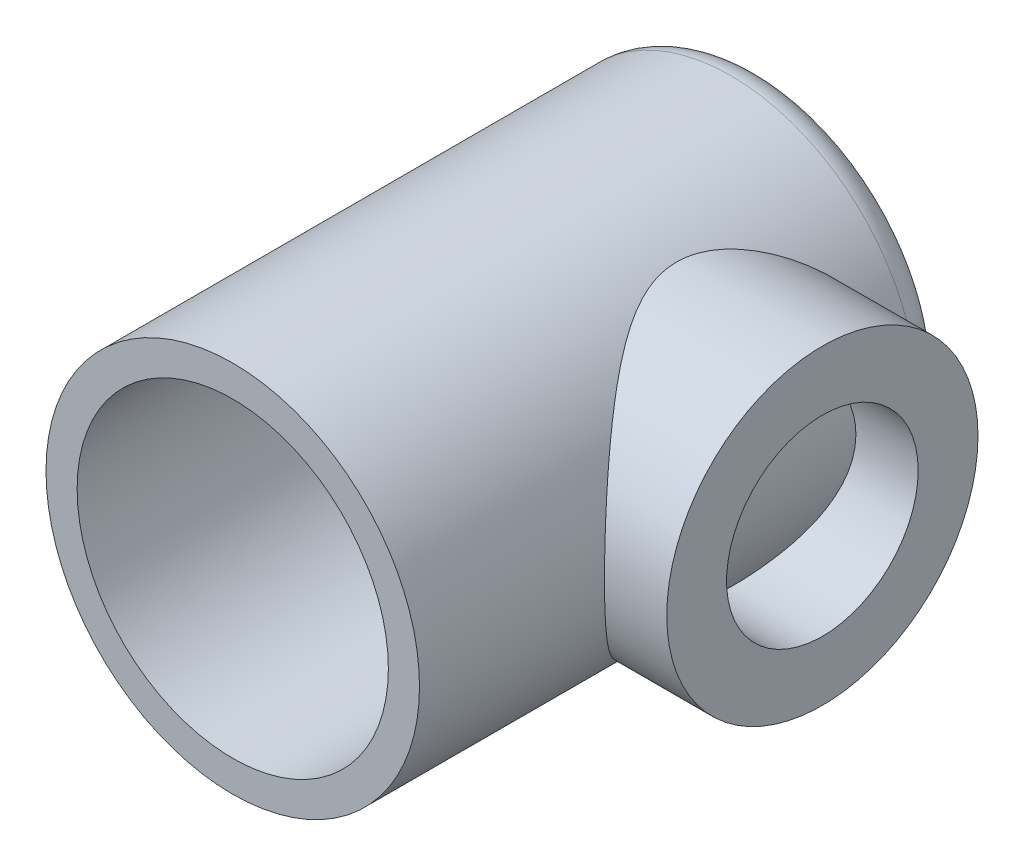
ISO-10303-21;
HEADER;
FILE_DESCRIPTION(('STEP AP214'),'2;1');
FILE_NAME('part.step','',(''),(''),'','','');
FILE_SCHEMA(('AUTOMOTIVE_DESIGN { 1 0 10303 214 1 1 1 1 }'));
ENDSEC;
DATA;
#1=APPLICATION_CONTEXT('core data for automotive mechanical design processes');
#2=APPLICATION_PROTOCOL_DEFINITION('international standard','automotive_design',2000,#1);
#3=PRODUCT_CONTEXT('',#1,'mechanical');
#4=PRODUCT('Part','Part','',(#3));
#5=PRODUCT_RELATED_PRODUCT_CATEGORY('part','',(#4));
#6=PRODUCT_DEFINITION_FORMATION('','',#4);
#7=PRODUCT_DEFINITION_CONTEXT('part definition',#1,'design');
#8=PRODUCT_DEFINITION('design','',#6,#7);
#9=PRODUCT_DEFINITION_SHAPE('','',#8);
#10=(LENGTH_UNIT() NAMED_UNIT(*) SI_UNIT(.MILLI.,.METRE.));
#11=(NAMED_UNIT(*) PLANE_ANGLE_UNIT() SI_UNIT($,.RADIAN.));
#12=(NAMED_UNIT(*) SI_UNIT($,.STERADIAN.) SOLID_ANGLE_UNIT());
#13=UNCERTAINTY_MEASURE_WITH_UNIT(LENGTH_MEASURE(1.E-05),#10,'distance_accuracy_value','');
#14=(GEOMETRIC_REPRESENTATION_CONTEXT(3) GLOBAL_UNCERTAINTY_ASSIGNED_CONTEXT((#13)) GLOBAL_UNIT_ASSIGNED_CONTEXT((#10,
#11,#12)) REPRESENTATION_CONTEXT('',''));
#15=CARTESIAN_POINT('',(0.,0.,0.));
#16=DIRECTION('',(0.,0.,1.));
#17=DIRECTION('',(1.,0.,0.));
#18=AXIS2_PLACEMENT_3D('',#15,#16,#17);
#19=CARTESIAN_POINT('',(0.,0.,0.));
#20=DIRECTION('',(0.,0.,1.));
#21=DIRECTION('',(1.,0.,0.));
#22=AXIS2_PLACEMENT_3D('',#19,#20,#21);
#23=CYLINDRICAL_SURFACE('',#22,3.);
#24=CARTESIAN_POINT('',(0.,0.,0.));
#25=DIRECTION('',(0.,0.,-1.));
#26=DIRECTION('',(-1.,0.,0.));
#27=AXIS2_PLACEMENT_3D('',#24,#25,#26);
#28=CIRCLE('',#27,3.);
#29=CARTESIAN_POINT('',(-3.,0.,0.));
#30=VERTEX_POINT('',#29);
#31=EDGE_CURVE('E10',#30,#30,#28,.F.);
#32=ORIENTED_EDGE('',*,*,#31,.T.);
#33=EDGE_LOOP('',(#32));
#34=FACE_BOUND('',#33,.T.);
#35=CARTESIAN_POINT('',(3.,0.,0.0279198848584191));
#36=CARTESIAN_POINT('',(2.99999522795205,0.118757533193203,0.0279247704121019));
#37=CARTESIAN_POINT('',(2.99288670594742,0.237551281104128,0.0364423887629974));
#38=CARTESIAN_POINT('',(2.96510762868268,0.471182492492811,0.069882608210253));
#39=CARTESIAN_POINT('',(2.94442702942007,0.586016959612417,0.0948173588337277));
#40=CARTESIAN_POINT('',(2.89142690238865,0.807829942407297,0.159232002191125));
#41=CARTESIAN_POINT('',(2.8591769655007,0.914850920904901,0.198624959212131));
#42=CARTESIAN_POINT('',(2.78529176182903,1.11984139043408,0.289936932800996));
#43=CARTESIAN_POINT('',(2.74365332434937,1.21780780775233,0.341860181531668));
#44=CARTESIAN_POINT('',(2.63674191529867,1.43789998519767,0.477373634666574));
#45=CARTESIAN_POINT('',(2.56840549256191,1.5556821965722,0.565590089040597));
#46=CARTESIAN_POINT('',(2.42422624777674,1.77202398328147,0.758444210609786));
#47=CARTESIAN_POINT('',(2.34836281453276,1.87052845158605,0.863127454101528));
#48=CARTESIAN_POINT('',(2.23294886313738,2.00437263805588,1.03200416134951));
#49=CARTESIAN_POINT('',(2.19383679994997,2.04699726278816,1.09087546104972));
#50=CARTESIAN_POINT('',(2.11620611809193,2.12715295529554,1.21242548781892));
#51=CARTESIAN_POINT('',(2.07768770195023,2.16468231743739,1.27510547972916));
#52=CARTESIAN_POINT('',(2.00250543288661,2.23441122570746,1.40418720919403));
#53=CARTESIAN_POINT('',(1.96583735754651,2.26662332666227,1.47057966958324));
#54=CARTESIAN_POINT('',(1.89577686630311,2.32553690612792,1.60736616878681));
#55=CARTESIAN_POINT('',(1.86238167220904,2.3522430799868,1.67775673220021));
#56=CARTESIAN_POINT('',(1.79791918980412,2.40193513934005,1.82958697505852));
#57=CARTESIAN_POINT('',(1.76736311251003,2.42433807692598,1.9114439775819));
#58=CARTESIAN_POINT('',(1.71593180556003,2.46101313675502,2.07980965367152));
#59=CARTESIAN_POINT('',(1.69503310194197,2.47530499393792,2.16630647147309));
#60=CARTESIAN_POINT('',(1.66620928968844,2.49481072799048,2.34368529323787));
#61=CARTESIAN_POINT('',(1.65844510563093,2.49991205058667,2.43460784392911));
#62=CARTESIAN_POINT('',(1.65818308531825,2.5000856937119,2.61648249786118));
#63=CARTESIAN_POINT('',(1.6656854491694,2.49515788278405,2.70743460147375));
#64=CARTESIAN_POINT('',(1.69541639464497,2.47505262029594,2.89344459568554));
#65=CARTESIAN_POINT('',(1.71881932066467,2.45905577113332,2.98821363057548));
#66=CARTESIAN_POINT('',(1.77688235738914,2.41742550503027,3.17213086606059));
#67=CARTESIAN_POINT('',(1.81157977103025,2.39176011044289,3.26125925557324));
#68=CARTESIAN_POINT('',(1.88002226126137,2.33816270346873,3.41574696339952));
#69=CARTESIAN_POINT('',(1.91250316845439,2.31177513033566,3.48223212727007));
#70=CARTESIAN_POINT('',(1.98021996661529,2.25404424958636,3.61157069163835));
#71=CARTESIAN_POINT('',(2.01545746697786,2.22269803586306,3.67442193272425));
#72=CARTESIAN_POINT('',(2.12342648109725,2.12149677560466,3.85788672587809));
#73=CARTESIAN_POINT('',(2.19837696967438,2.04450664231777,3.9733340324645));
#74=CARTESIAN_POINT('',(2.35079897952278,1.86765914501414,4.19618684731277));
#75=CARTESIAN_POINT('',(2.42819792618945,1.76681805277628,4.3028582088503));
#76=CARTESIAN_POINT('',(2.57509054043285,1.54484388336149,4.49903222967582));
#77=CARTESIAN_POINT('',(2.64460112267364,1.42375565615773,4.58857191791468));
#78=CARTESIAN_POINT('',(2.75428914126547,1.19411179169416,4.72733472395697));
#79=CARTESIAN_POINT('',(2.79748350073995,1.08972732107277,4.78106278304607));
#80=CARTESIAN_POINT('',(2.87307804019801,0.871071458330365,4.87426263011376));
#81=CARTESIAN_POINT('',(2.90548495660805,0.756806292780761,4.91374331643899));
#82=CARTESIAN_POINT('',(2.95709834265565,0.519954301215417,4.97633713479062));
#83=CARTESIAN_POINT('',(2.97620280955844,0.397310923125307,4.99932383151598));
#84=CARTESIAN_POINT('',(2.99891434528972,0.148559976923725,5.0266291167856));
#85=CARTESIAN_POINT('',(3.00253178304177,0.0224547835239998,5.03096019570858));
#86=CARTESIAN_POINT('',(2.99444999039147,-0.213310199456577,5.02125744541466));
#87=CARTESIAN_POINT('',(2.98453350716313,-0.323130540835861,5.00936124614325));
#88=CARTESIAN_POINT('',(2.95325589460135,-0.538644964400607,4.97165293464693));
#89=CARTESIAN_POINT('',(2.93189339242796,-0.644338549989564,4.94583915313945));
#90=CARTESIAN_POINT('',(2.87889521546186,-0.850565499199259,4.88129648940316));
#91=CARTESIAN_POINT('',(2.84712564891974,-0.951010682223319,4.84239909541415));
#92=CARTESIAN_POINT('',(2.77536124733889,-1.14365900898104,4.75352425252172));
#93=CARTESIAN_POINT('',(2.73536337221808,-1.2358590883121,4.70354270786512));
#94=CARTESIAN_POINT('',(2.62975152158594,-1.450674397351,4.56948808951145));
#95=CARTESIAN_POINT('',(2.56070244234714,-1.56834359540731,4.48018730159111));
#96=CARTESIAN_POINT('',(2.4152244540319,-1.78428994740848,4.28507950220278));
#97=CARTESIAN_POINT('',(2.33877300422834,-1.88250490855173,4.17922142950367));
#98=CARTESIAN_POINT('',(2.222698055986,-2.01573314784291,4.0085079169298));
#99=CARTESIAN_POINT('',(2.1834115173603,-2.05811069143949,3.94902161188243));
#100=CARTESIAN_POINT('',(2.10553153817181,-2.13771669597406,3.82619906882614));
#101=CARTESIAN_POINT('',(2.06693835133607,-2.17494330406755,3.76286145719432));
#102=CARTESIAN_POINT('',(1.99176108482639,-2.24398857026758,3.63243148094323));
#103=CARTESIAN_POINT('',(1.95517188634212,-2.27582148781538,3.56534966032481));
#104=CARTESIAN_POINT('',(1.88547561448179,-2.3338885673946,3.42712978035859));
#105=CARTESIAN_POINT('',(1.8523653645079,-2.36012785984655,3.35599551443904));
#106=CARTESIAN_POINT('',(1.78925557416047,-2.40837357148322,3.20364951650653));
#107=CARTESIAN_POINT('',(1.75970711786653,-2.42988314318545,3.12208543378469));
#108=CARTESIAN_POINT('',(1.71043063887427,-2.46482255689514,2.95446793091581));
#109=CARTESIAN_POINT('',(1.69067811225259,-2.47827257713357,2.86842631353054));
#110=CARTESIAN_POINT('',(1.6641531597946,-2.49617289535263,2.69228227744608));
#111=CARTESIAN_POINT('',(1.65753251048391,-2.5005179918396,2.60214455510773));
#112=CARTESIAN_POINT('',(1.65924308630667,-2.49938197104455,2.42206667207448));
#113=CARTESIAN_POINT('',(1.66757825402155,-2.49389826274012,2.33212656973328));
#114=CARTESIAN_POINT('',(1.69892898735519,-2.4726526384854,2.14624730946789));
#115=CARTESIAN_POINT('',(1.72341371023858,-2.45585812550761,2.05068961432574));
#116=CARTESIAN_POINT('',(1.78358728037387,-2.41250339675091,1.86538858877571));
#117=CARTESIAN_POINT('',(1.81931312531326,-2.38591088285909,1.77566565614912));
#118=CARTESIAN_POINT('',(1.88952619366194,-2.33050835844919,1.62013084350357));
#119=CARTESIAN_POINT('',(1.92277816627791,-2.30325853049531,1.55317612562349));
#120=CARTESIAN_POINT('',(1.99195185230571,-2.24370627018012,1.42297349843401));
#121=CARTESIAN_POINT('',(2.0278751115052,-2.21140090020864,1.3597277738586));
#122=CARTESIAN_POINT('',(2.13775931167913,-2.10716294428985,1.17519032351646));
#123=CARTESIAN_POINT('',(2.2137978016432,-2.02793576743751,1.05917295986648));
#124=CARTESIAN_POINT('',(2.36772603763547,-1.84629697567413,0.835912623567164));
#125=CARTESIAN_POINT('',(2.44552394429513,-1.7429395959328,0.72937809082549));
#126=CARTESIAN_POINT('',(2.59256498427755,-1.5155355493562,0.534056085319074));
#127=CARTESIAN_POINT('',(2.66182692543068,-1.39153583663215,0.445229318984465));
#128=CARTESIAN_POINT('',(2.76942305781509,-1.15855518141082,0.309605688135323));
#129=CARTESIAN_POINT('',(2.81112174006883,-1.05399877947693,0.257881374638973));
#130=CARTESIAN_POINT('',(2.88361460666453,-0.835439786054351,0.168701214619839));
#131=CARTESIAN_POINT('',(2.9144233132377,-0.721450026753897,0.131226360763123));
#132=CARTESIAN_POINT('',(2.95858745904691,-0.506620038886852,0.0777314290318304));
#133=CARTESIAN_POINT('',(2.97402142398111,-0.406845468761919,0.0591447626316421));
#134=CARTESIAN_POINT('',(2.99472922794408,-0.204722725654234,0.0342375166203394));
#135=CARTESIAN_POINT('',(3.00000411373941,-0.102374818922783,0.0279156732714977));
#136=CARTESIAN_POINT('',(3.,0.,0.0279198848584191));
#137=B_SPLINE_CURVE_WITH_KNOTS('',3,(#35,#36,#37,#38,#39,#40,#41,#42,#43,#44,#45,#46,#47,#48,
#49,#50,#51,#52,#53,#54,#55,#56,#57,#58,#59,#60,#61,#62,#63,#64,#65,#66,#67,#68,#69,#70,#71,#72,
#73,#74,#75,#76,#77,#78,#79,#80,#81,#82,#83,#84,#85,#86,#87,#88,#89,#90,#91,#92,#93,#94,#95,#96,
#97,#98,#99,#100,#101,#102,#103,#104,#105,#106,#107,#108,#109,#110,#111,#112,#113,#114,#115,
#116,#117,#118,#119,#120,#121,#122,#123,#124,#125,#126,#127,#128,#129,#130,#131,#132,#133,#134,
#135,#136),.UNSPECIFIED.,.T.,.F.,(4,2,2,2,2,2,2,2,2,2,2,2,2,2,2,2,2,2,2,2,2,2,2,2,2,2,2,2,2,2,2,
2,2,2,2,2,2,2,2,2,2,2,2,2,2,2,2,2,2,2,4),(0.,0.355841276815113,0.711946191026961,
1.06594405359551,1.42006164830116,1.90425178760126,2.38980643116775,2.63722280423449,
2.88472179650724,3.13162777943676,3.37832232674674,3.64812890035755,3.91727616616869,
4.18969776924975,4.46212294312047,4.75723524199722,5.05333228584568,5.28870178855694,
5.52420974868633,5.9954933935898,6.49137310548272,6.98616858956867,7.36002155957576,
7.73364063000476,8.11009395319721,8.48629519274361,8.81743460677927,9.14861374669872,
9.48423297747608,9.81997643164434,10.3065635514456,10.7946819775667,11.0432812121088,
11.2919696391639,11.5399899810636,11.787781852862,12.0551105531685,12.3217671309317,
12.5914881373799,12.8612802568452,13.1598101383752,13.4593330283462,13.6977271411687,
13.9362602949129,14.4135864576438,14.914300110886,15.413889999571,15.7841228897599,
16.1538601797496,16.4606444271243,16.7673970625124),.UNSPECIFIED.);
#138=CARTESIAN_POINT('',(3.,0.,0.0279198848584191));
#139=VERTEX_POINT('',#138);
#140=EDGE_CURVE('E49',#139,#139,#137,.T.);
#141=ORIENTED_EDGE('',*,*,#140,.F.);
#142=EDGE_LOOP('',(#141));
#143=FACE_BOUND('',#142,.T.);
#144=CARTESIAN_POINT('',(0.,0.,8.00000000000001));
#145=DIRECTION('',(0.,0.,1.));
#146=DIRECTION('',(1.,0.,0.));
#147=AXIS2_PLACEMENT_3D('',#144,#145,#146);
#148=CIRCLE('',#147,3.);
#149=CARTESIAN_POINT('',(3.,0.,8.00000000000001));
#150=VERTEX_POINT('',#149);
#151=EDGE_CURVE('E53',#150,#150,#148,.T.);
#152=ORIENTED_EDGE('',*,*,#151,.F.);
#153=EDGE_LOOP('',(#152));
#154=FACE_BOUND('',#153,.T.);
#155=ADVANCED_FACE('F38',(#34,#143,#154),#23,.T.);
#156=CARTESIAN_POINT('',(0.,0.,8.00000000000001));
#157=DIRECTION('',(0.,0.,1.));
#158=DIRECTION('',(1.,0.,0.));
#159=AXIS2_PLACEMENT_3D('',#156,#157,#158);
#160=PLANE('',#159);
#161=CARTESIAN_POINT('',(0.,0.,8.00000000000001));
#162=DIRECTION('',(0.,0.,1.));
#163=DIRECTION('',(1.,0.,0.));
#164=AXIS2_PLACEMENT_3D('',#161,#162,#163);
#165=CIRCLE('',#164,2.5);
#166=CARTESIAN_POINT('',(2.5,0.,8.00000000000001));
#167=VERTEX_POINT('',#166);
#168=EDGE_CURVE('E89',#167,#167,#165,.T.);
#169=ORIENTED_EDGE('',*,*,#168,.F.);
#170=EDGE_LOOP('',(#169));
#171=FACE_BOUND('',#170,.T.);
#172=ORIENTED_EDGE('',*,*,#151,.T.);
#173=EDGE_LOOP('',(#172));
#174=FACE_BOUND('',#173,.T.);
#175=ADVANCED_FACE('F109',(#171,#174),#160,.T.);
#176=CARTESIAN_POINT('',(0.,0.,0.));
#177=DIRECTION('',(0.,0.,1.));
#178=DIRECTION('',(1.,0.,0.));
#179=AXIS2_PLACEMENT_3D('',#176,#177,#178);
#180=CYLINDRICAL_SURFACE('',#179,2.5);
#181=CARTESIAN_POINT('',(0.,0.,0.));
#182=DIRECTION('',(0.,0.,1.));
#183=DIRECTION('',(1.,0.,0.));
#184=AXIS2_PLACEMENT_3D('',#181,#182,#183);
#185=CIRCLE('',#184,2.5);
#186=CARTESIAN_POINT('',(2.5,0.,0.));
#187=VERTEX_POINT('',#186);
#188=EDGE_CURVE('E87',#187,#187,#185,.T.);
#189=ORIENTED_EDGE('',*,*,#188,.F.);
#190=EDGE_LOOP('',(#189));
#191=FACE_BOUND('',#190,.T.);
#192=ORIENTED_EDGE('',*,*,#168,.T.);
#193=EDGE_LOOP('',(#192));
#194=FACE_BOUND('',#193,.T.);
#195=ADVANCED_FACE('F69',(#191,#194),#180,.F.);
#196=CARTESIAN_POINT('',(-3.001,0.,2.52791988485842));
#197=DIRECTION('',(1.,0.,0.));
#198=DIRECTION('',(0.,0.,-1.));
#199=AXIS2_PLACEMENT_3D('',#196,#197,#198);
#200=CYLINDRICAL_SURFACE('',#199,2.5);
#201=ORIENTED_EDGE('',*,*,#140,.T.);
#202=EDGE_LOOP('',(#201));
#203=FACE_BOUND('',#202,.T.);
#204=CARTESIAN_POINT('',(4.,0.,2.52791988485842));
#205=DIRECTION('',(1.,0.,0.));
#206=DIRECTION('',(0.,0.,-1.));
#207=AXIS2_PLACEMENT_3D('',#204,#205,#206);
#208=CIRCLE('',#207,2.5);
#209=CARTESIAN_POINT('',(4.,0.,0.0279198848584191));
#210=VERTEX_POINT('',#209);
#211=EDGE_CURVE('E85',#210,#210,#208,.T.);
#212=ORIENTED_EDGE('',*,*,#211,.F.);
#213=EDGE_LOOP('',(#212));
#214=FACE_BOUND('',#213,.T.);
#215=ADVANCED_FACE('F63',(#203,#214),#200,.T.);
#216=CARTESIAN_POINT('',(4.,0.,2.52791988485842));
#217=DIRECTION('',(1.,0.,0.));
#218=DIRECTION('',(0.,0.,-1.));
#219=AXIS2_PLACEMENT_3D('',#216,#217,#218);
#220=PLANE('',#219);
#221=CARTESIAN_POINT('',(4.,0.,2.52791988485842));
#222=DIRECTION('',(1.,0.,0.));
#223=DIRECTION('',(0.,0.,-1.));
#224=AXIS2_PLACEMENT_3D('',#221,#222,#223);
#225=CIRCLE('',#224,1.53910003291418);
#226=CARTESIAN_POINT('',(4.,0.,0.988819851944242));
#227=VERTEX_POINT('',#226);
#228=EDGE_CURVE('E84',#227,#227,#225,.T.);
#229=ORIENTED_EDGE('',*,*,#228,.F.);
#230=EDGE_LOOP('',(#229));
#231=FACE_BOUND('',#230,.T.);
#232=ORIENTED_EDGE('',*,*,#211,.T.);
#233=EDGE_LOOP('',(#232));
#234=FACE_BOUND('',#233,.T.);
#235=ADVANCED_FACE('F68',(#231,#234),#220,.T.);
#236=CARTESIAN_POINT('',(-3.001,0.,2.52791988485842));
#237=DIRECTION('',(1.,0.,0.));
#238=DIRECTION('',(0.,0.,-1.));
#239=AXIS2_PLACEMENT_3D('',#236,#237,#238);
#240=CYLINDRICAL_SURFACE('',#239,1.53910003291418);
#241=CARTESIAN_POINT('',(3.,0.,0.988819851944242));
#242=CARTESIAN_POINT('',(2.9999954334251,-0.0806583643793324,0.988825054675187));
#243=CARTESIAN_POINT('',(2.99671264774826,-0.161405207763551,0.995197495103371));
#244=CARTESIAN_POINT('',(2.98390362922332,-0.320496274447438,1.02039776508181));
#245=CARTESIAN_POINT('',(2.97436637345938,-0.398835999773485,1.03924758539209));
#246=CARTESIAN_POINT('',(2.95004284926415,-0.550571942206237,1.08846303710714));
#247=CARTESIAN_POINT('',(2.93527733960661,-0.623986363410859,1.1187831578092));
#248=CARTESIAN_POINT('',(2.90183800689915,-0.764568436110217,1.1898341576113));
#249=CARTESIAN_POINT('',(2.88316436110301,-0.831736370715264,1.23056456457067));
#250=CARTESIAN_POINT('',(2.84223278773989,-0.962656252629762,1.32417648827306));
#251=CARTESIAN_POINT('',(2.81982352103163,-1.02592980660358,1.37765984834648));
#252=CARTESIAN_POINT('',(2.77441563679962,-1.14305342470972,1.49395754286276));
#253=CARTESIAN_POINT('',(2.75141656148981,-1.19689589841517,1.55677931866885));
#254=CARTESIAN_POINT('',(2.70522995103951,-1.29810478586048,1.69619229394348));
#255=CARTESIAN_POINT('',(2.68218424951275,-1.34456686662354,1.77349268221968));
#256=CARTESIAN_POINT('',(2.64107138145109,-1.42363642739293,1.93610558219126));
#257=CARTESIAN_POINT('',(2.62300053388143,-1.45625416095664,2.02141210690763));
#258=CARTESIAN_POINT('',(2.59559907125033,-1.5045261087561,2.19233028729296));
#259=CARTESIAN_POINT('',(2.58580192703206,-1.52109495209868,2.27760489270263));
#260=CARTESIAN_POINT('',(2.57484394740715,-1.53958048447752,2.45023860073154));
#261=CARTESIAN_POINT('',(2.57367372851157,-1.54151309337842,2.53759533479539));
#262=CARTESIAN_POINT('',(2.57973058612761,-1.5313405466179,2.69991588982336));
#263=CARTESIAN_POINT('',(2.58590557544139,-1.52099455060364,2.77503915829008));
#264=CARTESIAN_POINT('',(2.60410253558526,-1.48962263184046,2.92228313456273));
#265=CARTESIAN_POINT('',(2.61612654209117,-1.46859299067197,2.99440278750453));
#266=CARTESIAN_POINT('',(2.64492083543831,-1.41608734177235,3.13565215376232));
#267=CARTESIAN_POINT('',(2.66179439405159,-1.38438113420936,3.20467424203702));
#268=CARTESIAN_POINT('',(2.69839852092557,-1.31160327099615,3.33675757710345));
#269=CARTESIAN_POINT('',(2.71813037126267,-1.27052740784393,3.39981612788087));
#270=CARTESIAN_POINT('',(2.76142969384319,-1.17374441283393,3.52710673802498));
#271=CARTESIAN_POINT('',(2.78515620106326,-1.11681268663386,3.59035694032917));
#272=CARTESIAN_POINT('',(2.83163456574649,-0.993083398009773,3.70683379707888));
#273=CARTESIAN_POINT('',(2.85438590452875,-0.926280667297284,3.76005516718427));
#274=CARTESIAN_POINT('',(2.8977702445653,-0.780386611744675,3.8575459048286));
#275=CARTESIAN_POINT('',(2.91823480256668,-0.700840810567728,3.90121630244183));
#276=CARTESIAN_POINT('',(2.95327513440646,-0.534218337379628,3.97418807461296));
#277=CARTESIAN_POINT('',(2.96785581083759,-0.447148008748726,4.00350141618881));
#278=CARTESIAN_POINT('',(2.98841836335484,-0.275940327352705,4.04441465724063));
#279=CARTESIAN_POINT('',(2.99502983577862,-0.192190647414302,4.05731682199561));
#280=CARTESIAN_POINT('',(3.00109320773056,-0.0234675565973687,4.06915923263176));
#281=CARTESIAN_POINT('',(3.00054877390842,0.0615052052855145,4.06810662886242));
#282=CARTESIAN_POINT('',(2.99271576474719,0.222793577353531,4.05278400783048));
#283=CARTESIAN_POINT('',(2.98598750304096,0.299244886772103,4.03961201550862));
#284=CARTESIAN_POINT('',(2.9672132266956,0.448686308158312,4.00218062948692));
#285=CARTESIAN_POINT('',(2.9551666391988,0.521676046328388,3.97792004138111));
#286=CARTESIAN_POINT('',(2.92642381754675,0.664451191748172,3.91841658144919));
#287=CARTESIAN_POINT('',(2.90960938218974,0.734094282345805,3.88289138400203));
#288=CARTESIAN_POINT('',(2.87291728158962,0.866650978161932,3.80219357427297));
#289=CARTESIAN_POINT('',(2.85303834763862,0.92956177784089,3.75701696328611));
#290=CARTESIAN_POINT('',(2.80971511352872,1.05368396483722,3.65299224724613));
#291=CARTESIAN_POINT('',(2.78611398506056,1.11406693670282,3.59321949829886));
#292=CARTESIAN_POINT('',(2.73944941846764,1.22434044877912,3.46441110824417));
#293=CARTESIAN_POINT('',(2.71638641349815,1.2742227792518,3.39536828805728));
#294=CARTESIAN_POINT('',(2.67211955893678,1.36471851323285,3.24518797116145));
#295=CARTESIAN_POINT('',(2.65108990138423,1.40466394479197,3.16359192004445));
#296=CARTESIAN_POINT('',(2.61552869943758,1.46983226730945,2.99342323880323));
#297=CARTESIAN_POINT('',(2.60098839005558,1.49507503091905,2.90486021025357));
#298=CARTESIAN_POINT('',(2.58193809885911,1.52771769223107,2.73246075098635));
#299=CARTESIAN_POINT('',(2.57658977690276,1.53661480389488,2.64900295511489));
#300=CARTESIAN_POINT('',(2.57416565242465,1.54067596907499,2.48165094313804));
#301=CARTESIAN_POINT('',(2.57708557703657,1.53584711589357,2.39775697480508));
#302=CARTESIAN_POINT('',(2.58996130586566,1.51401061150712,2.24124102292612));
#303=CARTESIAN_POINT('',(2.59914550315014,1.49833608882305,2.1683609496566));
#304=CARTESIAN_POINT('',(2.62255929447323,1.45696406588585,2.02636521382449));
#305=CARTESIAN_POINT('',(2.63679058837818,1.43126318845605,1.95725082860736));
#306=CARTESIAN_POINT('',(2.66984592119208,1.36866777611857,1.81963373999255));
#307=CARTESIAN_POINT('',(2.68891274828116,1.33114164022296,1.75147846346874));
#308=CARTESIAN_POINT('',(2.72912101455651,1.24663068177228,1.62198040180896));
#309=CARTESIAN_POINT('',(2.75026355481061,1.19964082511404,1.56064126949366));
#310=CARTESIAN_POINT('',(2.79553775045959,1.09036767751945,1.43819170823103));
#311=CARTESIAN_POINT('',(2.81969983716141,1.02688934084228,1.3781530823206));
#312=CARTESIAN_POINT('',(2.86580631828732,0.890144766305838,1.26930634471666));
#313=CARTESIAN_POINT('',(2.88774943130086,0.816872928967007,1.22050470160728));
#314=CARTESIAN_POINT('',(2.92737307858611,0.661082159218582,1.13515623590148));
#315=CARTESIAN_POINT('',(2.94499362248556,0.578454081656965,1.09877940311826));
#316=CARTESIAN_POINT('',(2.97349801695449,0.407171092986858,1.04092270110484));
#317=CARTESIAN_POINT('',(2.98440058832763,0.318533701108704,1.01940141396596));
#318=CARTESIAN_POINT('',(2.99417045948236,0.190769828579684,1.00020837236196));
#319=CARTESIAN_POINT('',(2.99635016225257,0.152781655150096,0.995944433762183));
#320=CARTESIAN_POINT('',(2.99926603465457,0.0765356346485203,0.990248902594063));
#321=CARTESIAN_POINT('',(3.00000216714477,0.0382777806633445,0.988817382900945));
#322=CARTESIAN_POINT('',(3.,0.,0.988819851944242));
#323=B_SPLINE_CURVE_WITH_KNOTS('',3,(#241,#242,#243,#244,#245,#246,#247,#248,#249,#250,#251,
#252,#253,#254,#255,#256,#257,#258,#259,#260,#261,#262,#263,#264,#265,#266,#267,#268,#269,#270,
#271,#272,#273,#274,#275,#276,#277,#278,#279,#280,#281,#282,#283,#284,#285,#286,#287,#288,#289,
#290,#291,#292,#293,#294,#295,#296,#297,#298,#299,#300,#301,#302,#303,#304,#305,#306,#307,#308,
#309,#310,#311,#312,#313,#314,#315,#316,#317,#318,#319,#320,#321,#322),.UNSPECIFIED.,.T.,.F.,(4,
2,2,2,2,2,2,2,2,2,2,2,2,2,2,2,2,2,2,2,2,2,2,2,2,2,2,2,2,2,2,2,2,2,2,2,2,2,2,2,4),(0.,
0.241820141262179,0.484067617303665,0.725363841023312,0.966649123108047,1.22306613695825,
1.47968858431727,1.75754235799105,2.03518998383677,2.29587490311087,2.55627623404045,
2.78346175266881,3.01072639695197,3.24324350245259,3.47586522747387,3.739759086375,
4.00379160839994,4.28136295365539,4.55870253981175,4.81228472648524,5.06573698401327,
5.29827140448136,5.53083087825524,5.76975344605506,6.00877519519226,6.27218623040921,
6.53580245015537,6.81404752643839,7.09191563872164,7.34274538561432,7.59344553231375,
7.81780094541087,8.04223199347075,8.281613071968,8.52112182404337,8.79184715792085,
9.06272794774298,9.33717882291473,9.61086139244124,9.7256182468804,9.8403780538569),.UNSPECIFIED.);
#324=CARTESIAN_POINT('',(3.,0.,0.988819851944242));
#325=VERTEX_POINT('',#324);
#326=EDGE_CURVE('E77',#325,#325,#323,.T.);
#327=ORIENTED_EDGE('',*,*,#326,.T.);
#328=EDGE_LOOP('',(#327));
#329=FACE_BOUND('',#328,.T.);
#330=ORIENTED_EDGE('',*,*,#228,.T.);
#331=EDGE_LOOP('',(#330));
#332=FACE_BOUND('',#331,.T.);
#333=ADVANCED_FACE('F71',(#329,#332),#240,.F.);
#334=ORIENTED_EDGE('',*,*,#326,.F.);
#335=EDGE_LOOP('',(#334));
#336=FACE_BOUND('',#335,.T.);
#337=ADVANCED_FACE('F105',(#336),#23,.T.);
#338=CARTESIAN_POINT('',(0.,0.,0.));
#339=DIRECTION('',(0.,0.,-1.));
#340=DIRECTION('',(-1.,0.,0.));
#341=AXIS2_PLACEMENT_3D('',#338,#339,#340);
#342=PLANE('',#341);
#343=ORIENTED_EDGE('',*,*,#188,.T.);
#344=EDGE_LOOP('',(#343));
#345=FACE_BOUND('',#344,.T.);
#346=ADVANCED_FACE('F116',(#345),#342,.F.);
#347=CARTESIAN_POINT('',(0.,0.,-0.5));
#348=DIRECTION('',(0.,0.,-1.));
#349=DIRECTION('',(-1.,0.,0.));
#350=AXIS2_PLACEMENT_3D('',#347,#348,#349);
#351=PLANE('',#350);
#352=CARTESIAN_POINT('',(0.,0.,-0.5));
#353=DIRECTION('',(0.,0.,-1.));
#354=DIRECTION('',(-1.,0.,0.));
#355=AXIS2_PLACEMENT_3D('',#352,#353,#354);
#356=CIRCLE('',#355,2.5);
#357=CARTESIAN_POINT('',(-2.5,0.,-0.5));
#358=VERTEX_POINT('',#357);
#359=EDGE_CURVE('E45',#358,#358,#356,.T.);
#360=ORIENTED_EDGE('',*,*,#359,.T.);
#361=EDGE_LOOP('',(#360));
#362=FACE_BOUND('',#361,.T.);
#363=ADVANCED_FACE('F121',(#362),#351,.T.);
#364=CARTESIAN_POINT('',(0.,0.,0.));
#365=DIRECTION('',(0.,0.,-1.));
#366=DIRECTION('',(-1.,0.,0.));
#367=AXIS2_PLACEMENT_3D('',#364,#365,#366);
#368=TOROIDAL_SURFACE('',#367,2.5,0.5);
#369=ORIENTED_EDGE('',*,*,#31,.F.);
#370=EDGE_LOOP('',(#369));
#371=FACE_BOUND('',#370,.T.);
#372=ORIENTED_EDGE('',*,*,#359,.F.);
#373=EDGE_LOOP('',(#372));
#374=FACE_BOUND('',#373,.T.);
#375=ADVANCED_FACE('F40',(#371,#374),#368,.T.);
#376=CLOSED_SHELL('',(#155,#175,#195,#215,#235,#333,#337,#346,#363,#375));
#377=MANIFOLD_SOLID_BREP('B2',#376);
#378=ADVANCED_BREP_SHAPE_REPRESENTATION('',(#18,#377),#14);
#379=SHAPE_DEFINITION_REPRESENTATION(#9,#378);
ENDSEC;
END-ISO-10303-21;
